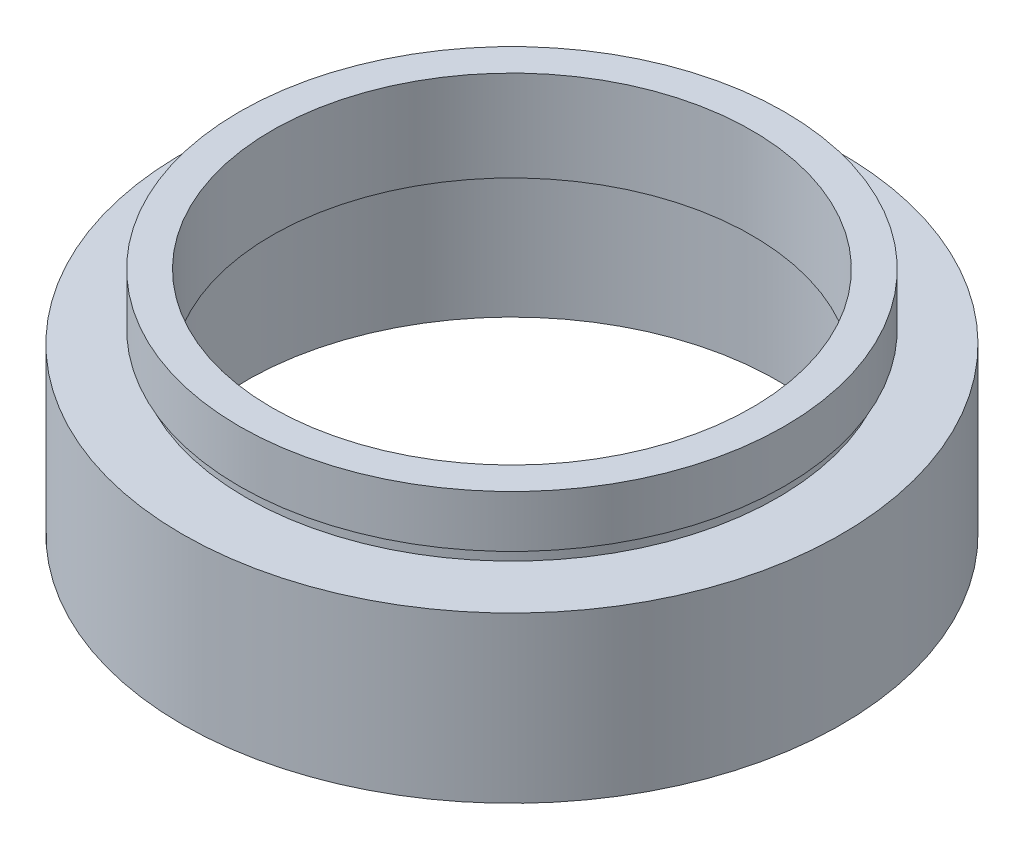
ISO-10303-21;
HEADER;
FILE_DESCRIPTION(('STEP AP214'),'2;1');
FILE_NAME('part.step','',(''),(''),'','','');
FILE_SCHEMA(('AUTOMOTIVE_DESIGN { 1 0 10303 214 1 1 1 1 }'));
ENDSEC;
DATA;
#1=APPLICATION_CONTEXT('core data for automotive mechanical design processes');
#2=APPLICATION_PROTOCOL_DEFINITION('international standard','automotive_design',2000,#1);
#3=PRODUCT_CONTEXT('',#1,'mechanical');
#4=PRODUCT('Part','Part','',(#3));
#5=PRODUCT_RELATED_PRODUCT_CATEGORY('part','',(#4));
#6=PRODUCT_DEFINITION_FORMATION('','',#4);
#7=PRODUCT_DEFINITION_CONTEXT('part definition',#1,'design');
#8=PRODUCT_DEFINITION('design','',#6,#7);
#9=PRODUCT_DEFINITION_SHAPE('','',#8);
#10=(LENGTH_UNIT() NAMED_UNIT(*) SI_UNIT(.MILLI.,.METRE.));
#11=(NAMED_UNIT(*) PLANE_ANGLE_UNIT() SI_UNIT($,.RADIAN.));
#12=(NAMED_UNIT(*) SI_UNIT($,.STERADIAN.) SOLID_ANGLE_UNIT());
#13=UNCERTAINTY_MEASURE_WITH_UNIT(LENGTH_MEASURE(1.E-05),#10,'distance_accuracy_value','');
#14=(GEOMETRIC_REPRESENTATION_CONTEXT(3) GLOBAL_UNCERTAINTY_ASSIGNED_CONTEXT((#13)) GLOBAL_UNIT_ASSIGNED_CONTEXT((#10,
#11,#12)) REPRESENTATION_CONTEXT('',''));
#15=CARTESIAN_POINT('',(0.,0.,0.));
#16=DIRECTION('',(0.,0.,1.));
#17=DIRECTION('',(1.,0.,0.));
#18=AXIS2_PLACEMENT_3D('',#15,#16,#17);
#19=CARTESIAN_POINT('',(0.,161.376166943427,0.));
#20=DIRECTION('',(0.,1.,0.));
#21=DIRECTION('',(0.,0.,1.));
#22=AXIS2_PLACEMENT_3D('',#19,#20,#21);
#23=CYLINDRICAL_SURFACE('',#22,18.5);
#24=CARTESIAN_POINT('',(0.,10.7,0.));
#25=DIRECTION('',(0.,1.,0.));
#26=DIRECTION('',(0.,0.,1.));
#27=AXIS2_PLACEMENT_3D('',#24,#25,#26);
#28=CIRCLE('',#27,18.5);
#29=CARTESIAN_POINT('',(0.,10.7,18.5));
#30=VERTEX_POINT('',#29);
#31=EDGE_CURVE('E77',#30,#30,#28,.T.);
#32=ORIENTED_EDGE('',*,*,#31,.F.);
#33=EDGE_LOOP('',(#32));
#34=FACE_BOUND('',#33,.T.);
#35=CARTESIAN_POINT('',(0.,17.7,0.));
#36=DIRECTION('',(0.,1.,0.));
#37=DIRECTION('',(0.,0.,1.));
#38=AXIS2_PLACEMENT_3D('',#35,#36,#37);
#39=CIRCLE('',#38,18.5);
#40=CARTESIAN_POINT('',(0.,17.7,18.5));
#41=VERTEX_POINT('',#40);
#42=EDGE_CURVE('E10',#41,#41,#39,.T.);
#43=ORIENTED_EDGE('',*,*,#42,.T.);
#44=EDGE_LOOP('',(#43));
#45=FACE_BOUND('',#44,.T.);
#46=ADVANCED_FACE('F37',(#34,#45),#23,.F.);
#47=CARTESIAN_POINT('',(18.5,17.7,0.));
#48=DIRECTION('',(0.,-1.,0.));
#49=DIRECTION('',(0.,0.,-1.));
#50=AXIS2_PLACEMENT_3D('',#47,#48,#49);
#51=PLANE('',#50);
#52=ORIENTED_EDGE('',*,*,#42,.F.);
#53=EDGE_LOOP('',(#52));
#54=FACE_BOUND('',#53,.T.);
#55=CARTESIAN_POINT('',(0.,17.7,0.));
#56=DIRECTION('',(0.,1.,0.));
#57=DIRECTION('',(0.,0.,1.));
#58=AXIS2_PLACEMENT_3D('',#55,#56,#57);
#59=CIRCLE('',#58,21.);
#60=CARTESIAN_POINT('',(0.,17.7,21.));
#61=VERTEX_POINT('',#60);
#62=EDGE_CURVE('E43',#61,#61,#59,.T.);
#63=ORIENTED_EDGE('',*,*,#62,.T.);
#64=EDGE_LOOP('',(#63));
#65=FACE_BOUND('',#64,.T.);
#66=ADVANCED_FACE('F84',(#54,#65),#51,.F.);
#67=CARTESIAN_POINT('',(0.,161.376166943427,0.));
#68=DIRECTION('',(0.,1.,0.));
#69=DIRECTION('',(0.,0.,1.));
#70=AXIS2_PLACEMENT_3D('',#67,#68,#69);
#71=CYLINDRICAL_SURFACE('',#70,21.);
#72=ORIENTED_EDGE('',*,*,#62,.F.);
#73=EDGE_LOOP('',(#72));
#74=FACE_BOUND('',#73,.T.);
#75=CARTESIAN_POINT('',(0.,13.7,0.));
#76=DIRECTION('',(0.,1.,0.));
#77=DIRECTION('',(0.,0.,1.));
#78=AXIS2_PLACEMENT_3D('',#75,#76,#77);
#79=CIRCLE('',#78,21.);
#80=CARTESIAN_POINT('',(0.,13.7,21.));
#81=VERTEX_POINT('',#80);
#82=EDGE_CURVE('E47',#81,#81,#79,.T.);
#83=ORIENTED_EDGE('',*,*,#82,.T.);
#84=EDGE_LOOP('',(#83));
#85=FACE_BOUND('',#84,.T.);
#86=ADVANCED_FACE('F88',(#74,#85),#71,.T.);
#87=CARTESIAN_POINT('',(21.,13.7,0.));
#88=DIRECTION('',(0.,1.,0.));
#89=DIRECTION('',(0.,0.,1.));
#90=AXIS2_PLACEMENT_3D('',#87,#88,#89);
#91=PLANE('',#90);
#92=ORIENTED_EDGE('',*,*,#82,.F.);
#93=EDGE_LOOP('',(#92));
#94=FACE_BOUND('',#93,.T.);
#95=CARTESIAN_POINT('',(0.,13.7,0.));
#96=DIRECTION('',(0.,1.,0.));
#97=DIRECTION('',(0.,0.,1.));
#98=AXIS2_PLACEMENT_3D('',#95,#96,#97);
#99=CIRCLE('',#98,20.5);
#100=CARTESIAN_POINT('',(0.,13.7,20.5));
#101=VERTEX_POINT('',#100);
#102=EDGE_CURVE('E51',#101,#101,#99,.T.);
#103=ORIENTED_EDGE('',*,*,#102,.T.);
#104=EDGE_LOOP('',(#103));
#105=FACE_BOUND('',#104,.T.);
#106=ADVANCED_FACE('F93',(#94,#105),#91,.F.);
#107=CARTESIAN_POINT('',(0.,161.376166943427,0.));
#108=DIRECTION('',(0.,1.,0.));
#109=DIRECTION('',(0.,0.,1.));
#110=AXIS2_PLACEMENT_3D('',#107,#108,#109);
#111=CYLINDRICAL_SURFACE('',#110,20.5);
#112=ORIENTED_EDGE('',*,*,#102,.F.);
#113=EDGE_LOOP('',(#112));
#114=FACE_BOUND('',#113,.T.);
#115=CARTESIAN_POINT('',(0.,12.7,0.));
#116=DIRECTION('',(0.,1.,0.));
#117=DIRECTION('',(0.,0.,1.));
#118=AXIS2_PLACEMENT_3D('',#115,#116,#117);
#119=CIRCLE('',#118,20.5);
#120=CARTESIAN_POINT('',(0.,12.7,20.5));
#121=VERTEX_POINT('',#120);
#122=EDGE_CURVE('E56',#121,#121,#119,.T.);
#123=ORIENTED_EDGE('',*,*,#122,.T.);
#124=EDGE_LOOP('',(#123));
#125=FACE_BOUND('',#124,.T.);
#126=ADVANCED_FACE('F99',(#114,#125),#111,.T.);
#127=CARTESIAN_POINT('',(20.5,12.7,0.));
#128=DIRECTION('',(0.,-1.,0.));
#129=DIRECTION('',(0.,0.,-1.));
#130=AXIS2_PLACEMENT_3D('',#127,#128,#129);
#131=PLANE('',#130);
#132=ORIENTED_EDGE('',*,*,#122,.F.);
#133=EDGE_LOOP('',(#132));
#134=FACE_BOUND('',#133,.T.);
#135=CARTESIAN_POINT('',(0.,12.7,0.));
#136=DIRECTION('',(0.,1.,0.));
#137=DIRECTION('',(0.,0.,1.));
#138=AXIS2_PLACEMENT_3D('',#135,#136,#137);
#139=CIRCLE('',#138,25.4);
#140=CARTESIAN_POINT('',(0.,12.7,25.4));
#141=VERTEX_POINT('',#140);
#142=EDGE_CURVE('E59',#141,#141,#139,.T.);
#143=ORIENTED_EDGE('',*,*,#142,.T.);
#144=EDGE_LOOP('',(#143));
#145=FACE_BOUND('',#144,.T.);
#146=ADVANCED_FACE('F103',(#134,#145),#131,.F.);
#147=CARTESIAN_POINT('',(0.,161.376166943427,0.));
#148=DIRECTION('',(0.,1.,0.));
#149=DIRECTION('',(0.,0.,1.));
#150=AXIS2_PLACEMENT_3D('',#147,#148,#149);
#151=CYLINDRICAL_SURFACE('',#150,25.4);
#152=ORIENTED_EDGE('',*,*,#142,.F.);
#153=EDGE_LOOP('',(#152));
#154=FACE_BOUND('',#153,.T.);
#155=CARTESIAN_POINT('',(0.,0.,0.));
#156=DIRECTION('',(0.,1.,0.));
#157=DIRECTION('',(0.,0.,1.));
#158=AXIS2_PLACEMENT_3D('',#155,#156,#157);
#159=CIRCLE('',#158,25.4);
#160=CARTESIAN_POINT('',(0.,0.,25.4));
#161=VERTEX_POINT('',#160);
#162=EDGE_CURVE('E62',#161,#161,#159,.T.);
#163=ORIENTED_EDGE('',*,*,#162,.T.);
#164=EDGE_LOOP('',(#163));
#165=FACE_BOUND('',#164,.T.);
#166=ADVANCED_FACE('F107',(#154,#165),#151,.T.);
#167=CARTESIAN_POINT('',(25.4,0.,0.));
#168=DIRECTION('',(0.,1.,0.));
#169=DIRECTION('',(0.,0.,1.));
#170=AXIS2_PLACEMENT_3D('',#167,#168,#169);
#171=PLANE('',#170);
#172=ORIENTED_EDGE('',*,*,#162,.F.);
#173=EDGE_LOOP('',(#172));
#174=FACE_BOUND('',#173,.T.);
#175=CARTESIAN_POINT('',(0.,0.,0.));
#176=DIRECTION('',(0.,1.,0.));
#177=DIRECTION('',(0.,0.,1.));
#178=AXIS2_PLACEMENT_3D('',#175,#176,#177);
#179=CIRCLE('',#178,20.5);
#180=CARTESIAN_POINT('',(0.,0.,20.5));
#181=VERTEX_POINT('',#180);
#182=EDGE_CURVE('E65',#181,#181,#179,.T.);
#183=ORIENTED_EDGE('',*,*,#182,.T.);
#184=EDGE_LOOP('',(#183));
#185=FACE_BOUND('',#184,.T.);
#186=ADVANCED_FACE('F111',(#174,#185),#171,.F.);
#187=CARTESIAN_POINT('',(0.,161.376166943427,0.));
#188=DIRECTION('',(0.,1.,0.));
#189=DIRECTION('',(0.,0.,1.));
#190=AXIS2_PLACEMENT_3D('',#187,#188,#189);
#191=CYLINDRICAL_SURFACE('',#190,20.5);
#192=ORIENTED_EDGE('',*,*,#182,.F.);
#193=EDGE_LOOP('',(#192));
#194=FACE_BOUND('',#193,.T.);
#195=CARTESIAN_POINT('',(0.,9.69999999999999,0.));
#196=DIRECTION('',(0.,1.,0.));
#197=DIRECTION('',(0.,0.,1.));
#198=AXIS2_PLACEMENT_3D('',#195,#196,#197);
#199=CIRCLE('',#198,20.5);
#200=CARTESIAN_POINT('',(0.,9.69999999999999,20.5));
#201=VERTEX_POINT('',#200);
#202=EDGE_CURVE('E68',#201,#201,#199,.T.);
#203=ORIENTED_EDGE('',*,*,#202,.T.);
#204=EDGE_LOOP('',(#203));
#205=FACE_BOUND('',#204,.T.);
#206=ADVANCED_FACE('F115',(#194,#205),#191,.F.);
#207=CARTESIAN_POINT('',(20.5,9.69999999999999,0.));
#208=DIRECTION('',(0.,-1.,0.));
#209=DIRECTION('',(0.,0.,-1.));
#210=AXIS2_PLACEMENT_3D('',#207,#208,#209);
#211=PLANE('',#210);
#212=ORIENTED_EDGE('',*,*,#202,.F.);
#213=EDGE_LOOP('',(#212));
#214=FACE_BOUND('',#213,.T.);
#215=CARTESIAN_POINT('',(0.,9.69999999999999,0.));
#216=DIRECTION('',(0.,1.,0.));
#217=DIRECTION('',(0.,0.,1.));
#218=AXIS2_PLACEMENT_3D('',#215,#216,#217);
#219=CIRCLE('',#218,21.1);
#220=CARTESIAN_POINT('',(0.,9.69999999999999,21.1));
#221=VERTEX_POINT('',#220);
#222=EDGE_CURVE('E71',#221,#221,#219,.T.);
#223=ORIENTED_EDGE('',*,*,#222,.T.);
#224=EDGE_LOOP('',(#223));
#225=FACE_BOUND('',#224,.T.);
#226=ADVANCED_FACE('F119',(#214,#225),#211,.F.);
#227=CARTESIAN_POINT('',(0.,161.376166943427,0.));
#228=DIRECTION('',(0.,1.,0.));
#229=DIRECTION('',(0.,0.,1.));
#230=AXIS2_PLACEMENT_3D('',#227,#228,#229);
#231=CYLINDRICAL_SURFACE('',#230,21.1);
#232=ORIENTED_EDGE('',*,*,#222,.F.);
#233=EDGE_LOOP('',(#232));
#234=FACE_BOUND('',#233,.T.);
#235=CARTESIAN_POINT('',(0.,10.7,0.));
#236=DIRECTION('',(0.,1.,0.));
#237=DIRECTION('',(0.,0.,1.));
#238=AXIS2_PLACEMENT_3D('',#235,#236,#237);
#239=CIRCLE('',#238,21.1);
#240=CARTESIAN_POINT('',(0.,10.7,21.1));
#241=VERTEX_POINT('',#240);
#242=EDGE_CURVE('E74',#241,#241,#239,.T.);
#243=ORIENTED_EDGE('',*,*,#242,.T.);
#244=EDGE_LOOP('',(#243));
#245=FACE_BOUND('',#244,.T.);
#246=ADVANCED_FACE('F123',(#234,#245),#231,.F.);
#247=CARTESIAN_POINT('',(21.1,10.7,0.));
#248=DIRECTION('',(0.,1.,0.));
#249=DIRECTION('',(0.,0.,1.));
#250=AXIS2_PLACEMENT_3D('',#247,#248,#249);
#251=PLANE('',#250);
#252=ORIENTED_EDGE('',*,*,#242,.F.);
#253=EDGE_LOOP('',(#252));
#254=FACE_BOUND('',#253,.T.);
#255=ORIENTED_EDGE('',*,*,#31,.T.);
#256=EDGE_LOOP('',(#255));
#257=FACE_BOUND('',#256,.T.);
#258=ADVANCED_FACE('F81',(#254,#257),#251,.F.);
#259=CLOSED_SHELL('',(#46,#66,#86,#106,#126,#146,#166,#186,#206,#226,#246,#258));
#260=MANIFOLD_SOLID_BREP('B2',#259);
#261=ADVANCED_BREP_SHAPE_REPRESENTATION('',(#18,#260),#14);
#262=SHAPE_DEFINITION_REPRESENTATION(#9,#261);
ENDSEC;
END-ISO-10303-21;
